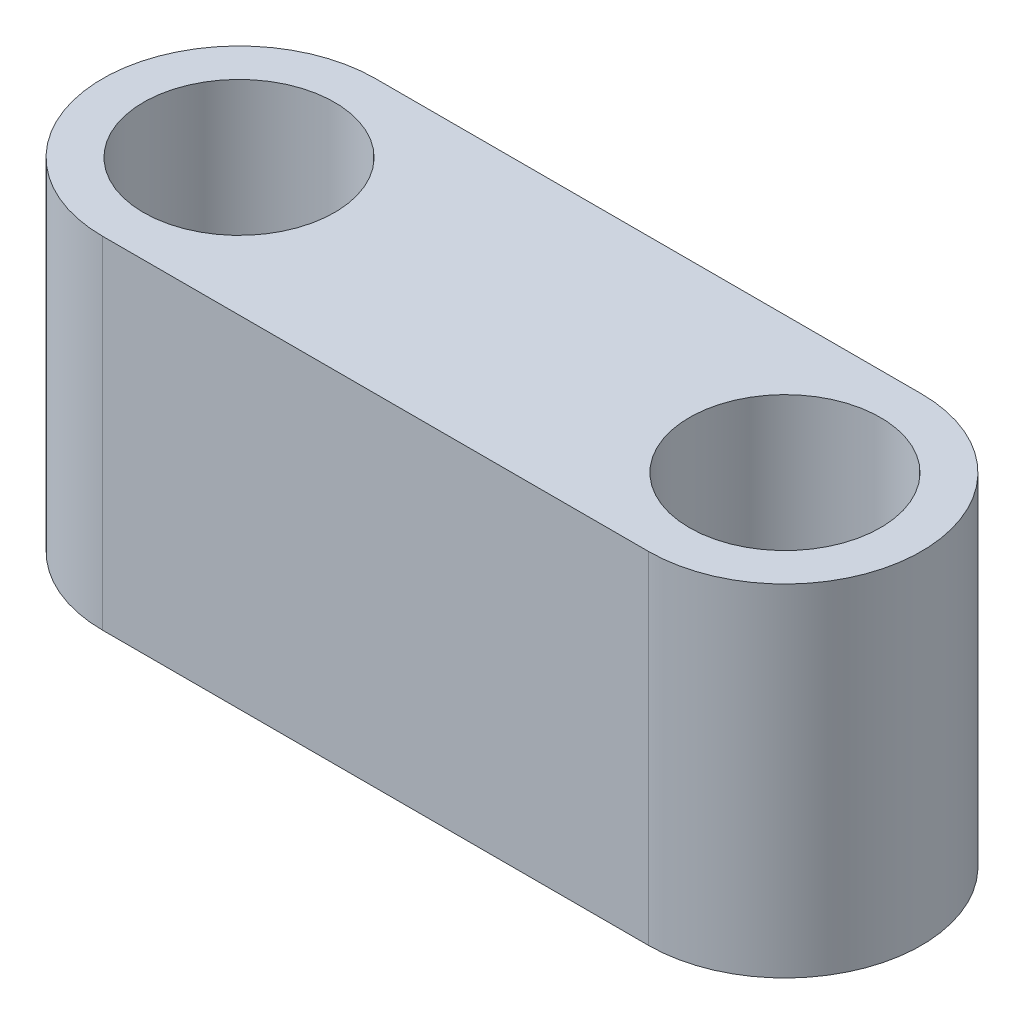
ISO-10303-21;
HEADER;
FILE_DESCRIPTION(('STEP AP214'),'2;1');
FILE_NAME('part.step','',(''),(''),'','','');
FILE_SCHEMA(('AUTOMOTIVE_DESIGN { 1 0 10303 214 1 1 1 1 }'));
ENDSEC;
DATA;
#1=APPLICATION_CONTEXT('core data for automotive mechanical design processes');
#2=APPLICATION_PROTOCOL_DEFINITION('international standard','automotive_design',2000,#1);
#3=PRODUCT_CONTEXT('',#1,'mechanical');
#4=PRODUCT('Part','Part','',(#3));
#5=PRODUCT_RELATED_PRODUCT_CATEGORY('part','',(#4));
#6=PRODUCT_DEFINITION_FORMATION('','',#4);
#7=PRODUCT_DEFINITION_CONTEXT('part definition',#1,'design');
#8=PRODUCT_DEFINITION('design','',#6,#7);
#9=PRODUCT_DEFINITION_SHAPE('','',#8);
#10=(LENGTH_UNIT() NAMED_UNIT(*) SI_UNIT(.MILLI.,.METRE.));
#11=(NAMED_UNIT(*) PLANE_ANGLE_UNIT() SI_UNIT($,.RADIAN.));
#12=(NAMED_UNIT(*) SI_UNIT($,.STERADIAN.) SOLID_ANGLE_UNIT());
#13=UNCERTAINTY_MEASURE_WITH_UNIT(LENGTH_MEASURE(1.E-05),#10,'distance_accuracy_value','');
#14=(GEOMETRIC_REPRESENTATION_CONTEXT(3) GLOBAL_UNCERTAINTY_ASSIGNED_CONTEXT((#13)) GLOBAL_UNIT_ASSIGNED_CONTEXT((#10,
#11,#12)) REPRESENTATION_CONTEXT('',''));
#15=CARTESIAN_POINT('',(0.,0.,0.));
#16=DIRECTION('',(0.,0.,1.));
#17=DIRECTION('',(1.,0.,0.));
#18=AXIS2_PLACEMENT_3D('',#15,#16,#17);
#19=CARTESIAN_POINT('',(-40.,50.,0.));
#20=DIRECTION('',(0.,1.,0.));
#21=DIRECTION('',(0.,0.,1.));
#22=AXIS2_PLACEMENT_3D('',#19,#20,#21);
#23=PLANE('',#22);
#24=CARTESIAN_POINT('',(40.,50.,0.));
#25=DIRECTION('',(0.,1.,0.));
#26=DIRECTION('',(0.,0.,1.));
#27=AXIS2_PLACEMENT_3D('',#24,#25,#26);
#28=CIRCLE('',#27,14.);
#29=CARTESIAN_POINT('',(40.,50.,14.));
#30=VERTEX_POINT('',#29);
#31=EDGE_CURVE('E114',#30,#30,#28,.T.);
#32=ORIENTED_EDGE('',*,*,#31,.F.);
#33=EDGE_LOOP('',(#32));
#34=FACE_BOUND('',#33,.T.);
#35=CARTESIAN_POINT('',(-40.,50.,0.));
#36=DIRECTION('',(0.,1.,0.));
#37=DIRECTION('',(0.,0.,1.));
#38=AXIS2_PLACEMENT_3D('',#35,#36,#37);
#39=CIRCLE('',#38,20.);
#40=CARTESIAN_POINT('',(-40.,50.,-20.));
#41=VERTEX_POINT('',#40);
#42=CARTESIAN_POINT('',(-40.,50.,20.));
#43=VERTEX_POINT('',#42);
#44=EDGE_CURVE('E94',#41,#43,#39,.T.);
#45=ORIENTED_EDGE('',*,*,#44,.T.);
#46=DIRECTION('',(1.,0.,0.));
#47=VECTOR('',#46,1.);
#48=CARTESIAN_POINT('',(-40.,50.,20.));
#49=LINE('',#48,#47);
#50=CARTESIAN_POINT('',(40.,50.,20.));
#51=VERTEX_POINT('',#50);
#52=EDGE_CURVE('E89',#43,#51,#49,.T.);
#53=ORIENTED_EDGE('',*,*,#52,.T.);
#54=CARTESIAN_POINT('',(40.,50.,0.));
#55=DIRECTION('',(0.,1.,0.));
#56=DIRECTION('',(0.,0.,1.));
#57=AXIS2_PLACEMENT_3D('',#54,#55,#56);
#58=CIRCLE('',#57,20.);
#59=CARTESIAN_POINT('',(40.,50.,-20.));
#60=VERTEX_POINT('',#59);
#61=EDGE_CURVE('E92',#51,#60,#58,.T.);
#62=ORIENTED_EDGE('',*,*,#61,.T.);
#63=DIRECTION('',(-1.,0.,0.));
#64=VECTOR('',#63,1.);
#65=CARTESIAN_POINT('',(-40.,50.,-20.));
#66=LINE('',#65,#64);
#67=EDGE_CURVE('E59',#60,#41,#66,.T.);
#68=ORIENTED_EDGE('',*,*,#67,.T.);
#69=EDGE_LOOP('',(#45,#53,#62,#68));
#70=FACE_BOUND('',#69,.T.);
#71=CARTESIAN_POINT('',(-40.,50.,0.));
#72=DIRECTION('',(0.,1.,0.));
#73=DIRECTION('',(0.,0.,1.));
#74=AXIS2_PLACEMENT_3D('',#71,#72,#73);
#75=CIRCLE('',#74,14.);
#76=CARTESIAN_POINT('',(-40.,50.,14.));
#77=VERTEX_POINT('',#76);
#78=EDGE_CURVE('E136',#77,#77,#75,.T.);
#79=ORIENTED_EDGE('',*,*,#78,.F.);
#80=EDGE_LOOP('',(#79));
#81=FACE_BOUND('',#80,.T.);
#82=ADVANCED_FACE('F41',(#34,#70,#81),#23,.T.);
#83=CARTESIAN_POINT('',(-40.,0.,0.));
#84=DIRECTION('',(0.,1.,0.));
#85=DIRECTION('',(0.,0.,1.));
#86=AXIS2_PLACEMENT_3D('',#83,#84,#85);
#87=PLANE('',#86);
#88=CARTESIAN_POINT('',(-40.,0.,0.));
#89=DIRECTION('',(0.,1.,0.));
#90=DIRECTION('',(0.,0.,1.));
#91=AXIS2_PLACEMENT_3D('',#88,#89,#90);
#92=CIRCLE('',#91,20.);
#93=CARTESIAN_POINT('',(-40.,0.,-20.));
#94=VERTEX_POINT('',#93);
#95=CARTESIAN_POINT('',(-40.,0.,20.));
#96=VERTEX_POINT('',#95);
#97=EDGE_CURVE('E110',#94,#96,#92,.T.);
#98=ORIENTED_EDGE('',*,*,#97,.F.);
#99=DIRECTION('',(-1.,0.,0.));
#100=VECTOR('',#99,1.);
#101=CARTESIAN_POINT('',(-40.,0.,-20.));
#102=LINE('',#101,#100);
#103=CARTESIAN_POINT('',(40.,0.,-20.));
#104=VERTEX_POINT('',#103);
#105=EDGE_CURVE('E82',#104,#94,#102,.T.);
#106=ORIENTED_EDGE('',*,*,#105,.F.);
#107=CARTESIAN_POINT('',(40.,0.,0.));
#108=DIRECTION('',(0.,1.,0.));
#109=DIRECTION('',(0.,0.,1.));
#110=AXIS2_PLACEMENT_3D('',#107,#108,#109);
#111=CIRCLE('',#110,20.);
#112=CARTESIAN_POINT('',(40.,0.,20.));
#113=VERTEX_POINT('',#112);
#114=EDGE_CURVE('E76',#113,#104,#111,.T.);
#115=ORIENTED_EDGE('',*,*,#114,.F.);
#116=DIRECTION('',(1.,0.,0.));
#117=VECTOR('',#116,1.);
#118=CARTESIAN_POINT('',(-40.,0.,20.));
#119=LINE('',#118,#117);
#120=EDGE_CURVE('E99',#96,#113,#119,.T.);
#121=ORIENTED_EDGE('',*,*,#120,.F.);
#122=EDGE_LOOP('',(#98,#106,#115,#121));
#123=FACE_BOUND('',#122,.T.);
#124=CARTESIAN_POINT('',(40.,0.,0.));
#125=DIRECTION('',(0.,1.,0.));
#126=DIRECTION('',(0.,0.,1.));
#127=AXIS2_PLACEMENT_3D('',#124,#125,#126);
#128=CIRCLE('',#127,14.);
#129=CARTESIAN_POINT('',(40.,0.,14.));
#130=VERTEX_POINT('',#129);
#131=EDGE_CURVE('E132',#130,#130,#128,.T.);
#132=ORIENTED_EDGE('',*,*,#131,.T.);
#133=EDGE_LOOP('',(#132));
#134=FACE_BOUND('',#133,.T.);
#135=CARTESIAN_POINT('',(-40.,0.,0.));
#136=DIRECTION('',(0.,1.,0.));
#137=DIRECTION('',(0.,0.,1.));
#138=AXIS2_PLACEMENT_3D('',#135,#136,#137);
#139=CIRCLE('',#138,14.);
#140=CARTESIAN_POINT('',(-40.,0.,14.));
#141=VERTEX_POINT('',#140);
#142=EDGE_CURVE('E140',#141,#141,#139,.T.);
#143=ORIENTED_EDGE('',*,*,#142,.T.);
#144=EDGE_LOOP('',(#143));
#145=FACE_BOUND('',#144,.T.);
#146=ADVANCED_FACE('F127',(#123,#134,#145),#87,.F.);
#147=CARTESIAN_POINT('',(-40.,50.,0.));
#148=DIRECTION('',(0.,-1.,0.));
#149=DIRECTION('',(0.,0.,-1.));
#150=AXIS2_PLACEMENT_3D('',#147,#148,#149);
#151=CYLINDRICAL_SURFACE('',#150,20.);
#152=ORIENTED_EDGE('',*,*,#97,.T.);
#153=DIRECTION('',(0.,-1.,0.));
#154=VECTOR('',#153,1.);
#155=CARTESIAN_POINT('',(-40.,50.,20.));
#156=LINE('',#155,#154);
#157=EDGE_CURVE('E11',#43,#96,#156,.T.);
#158=ORIENTED_EDGE('',*,*,#157,.F.);
#159=ORIENTED_EDGE('',*,*,#44,.F.);
#160=DIRECTION('',(0.,-1.,0.));
#161=VECTOR('',#160,1.);
#162=CARTESIAN_POINT('',(-40.,50.,-20.));
#163=LINE('',#162,#161);
#164=EDGE_CURVE('E106',#41,#94,#163,.T.);
#165=ORIENTED_EDGE('',*,*,#164,.T.);
#166=EDGE_LOOP('',(#152,#158,#159,#165));
#167=FACE_BOUND('',#166,.T.);
#168=ADVANCED_FACE('F43',(#167),#151,.T.);
#169=CARTESIAN_POINT('',(-40.,50.,20.));
#170=DIRECTION('',(0.,0.,-1.));
#171=DIRECTION('',(-1.,0.,0.));
#172=AXIS2_PLACEMENT_3D('',#169,#170,#171);
#173=PLANE('',#172);
#174=ORIENTED_EDGE('',*,*,#120,.T.);
#175=DIRECTION('',(0.,-1.,0.));
#176=VECTOR('',#175,1.);
#177=CARTESIAN_POINT('',(40.,50.,20.));
#178=LINE('',#177,#176);
#179=EDGE_CURVE('E51',#51,#113,#178,.T.);
#180=ORIENTED_EDGE('',*,*,#179,.F.);
#181=ORIENTED_EDGE('',*,*,#52,.F.);
#182=ORIENTED_EDGE('',*,*,#157,.T.);
#183=EDGE_LOOP('',(#174,#180,#181,#182));
#184=FACE_BOUND('',#183,.T.);
#185=ADVANCED_FACE('F98',(#184),#173,.F.);
#186=CARTESIAN_POINT('',(40.,50.,0.));
#187=DIRECTION('',(0.,-1.,0.));
#188=DIRECTION('',(0.,0.,-1.));
#189=AXIS2_PLACEMENT_3D('',#186,#187,#188);
#190=CYLINDRICAL_SURFACE('',#189,20.);
#191=ORIENTED_EDGE('',*,*,#114,.T.);
#192=DIRECTION('',(0.,-1.,0.));
#193=VECTOR('',#192,1.);
#194=CARTESIAN_POINT('',(40.,50.,-20.));
#195=LINE('',#194,#193);
#196=EDGE_CURVE('E101',#60,#104,#195,.T.);
#197=ORIENTED_EDGE('',*,*,#196,.F.);
#198=ORIENTED_EDGE('',*,*,#61,.F.);
#199=ORIENTED_EDGE('',*,*,#179,.T.);
#200=EDGE_LOOP('',(#191,#197,#198,#199));
#201=FACE_BOUND('',#200,.T.);
#202=ADVANCED_FACE('F102',(#201),#190,.T.);
#203=CARTESIAN_POINT('',(-40.,50.,-20.));
#204=DIRECTION('',(0.,0.,1.));
#205=DIRECTION('',(1.,0.,0.));
#206=AXIS2_PLACEMENT_3D('',#203,#204,#205);
#207=PLANE('',#206);
#208=ORIENTED_EDGE('',*,*,#105,.T.);
#209=ORIENTED_EDGE('',*,*,#164,.F.);
#210=ORIENTED_EDGE('',*,*,#67,.F.);
#211=ORIENTED_EDGE('',*,*,#196,.T.);
#212=EDGE_LOOP('',(#208,#209,#210,#211));
#213=FACE_BOUND('',#212,.T.);
#214=ADVANCED_FACE('F124',(#213),#207,.F.);
#215=CARTESIAN_POINT('',(40.,50.,0.));
#216=DIRECTION('',(0.,-1.,0.));
#217=DIRECTION('',(0.,0.,-1.));
#218=AXIS2_PLACEMENT_3D('',#215,#216,#217);
#219=CYLINDRICAL_SURFACE('',#218,14.);
#220=ORIENTED_EDGE('',*,*,#31,.T.);
#221=EDGE_LOOP('',(#220));
#222=FACE_BOUND('',#221,.T.);
#223=ORIENTED_EDGE('',*,*,#131,.F.);
#224=EDGE_LOOP('',(#223));
#225=FACE_BOUND('',#224,.T.);
#226=ADVANCED_FACE('F159',(#222,#225),#219,.F.);
#227=CARTESIAN_POINT('',(-40.,50.,0.));
#228=DIRECTION('',(0.,-1.,0.));
#229=DIRECTION('',(0.,0.,-1.));
#230=AXIS2_PLACEMENT_3D('',#227,#228,#229);
#231=CYLINDRICAL_SURFACE('',#230,14.);
#232=ORIENTED_EDGE('',*,*,#78,.T.);
#233=EDGE_LOOP('',(#232));
#234=FACE_BOUND('',#233,.T.);
#235=ORIENTED_EDGE('',*,*,#142,.F.);
#236=EDGE_LOOP('',(#235));
#237=FACE_BOUND('',#236,.T.);
#238=ADVANCED_FACE('F148',(#234,#237),#231,.F.);
#239=CLOSED_SHELL('',(#82,#146,#168,#185,#202,#214,#226,#238));
#240=MANIFOLD_SOLID_BREP('B2',#239);
#241=ADVANCED_BREP_SHAPE_REPRESENTATION('',(#18,#240),#14);
#242=SHAPE_DEFINITION_REPRESENTATION(#9,#241);
ENDSEC;
END-ISO-10303-21;
